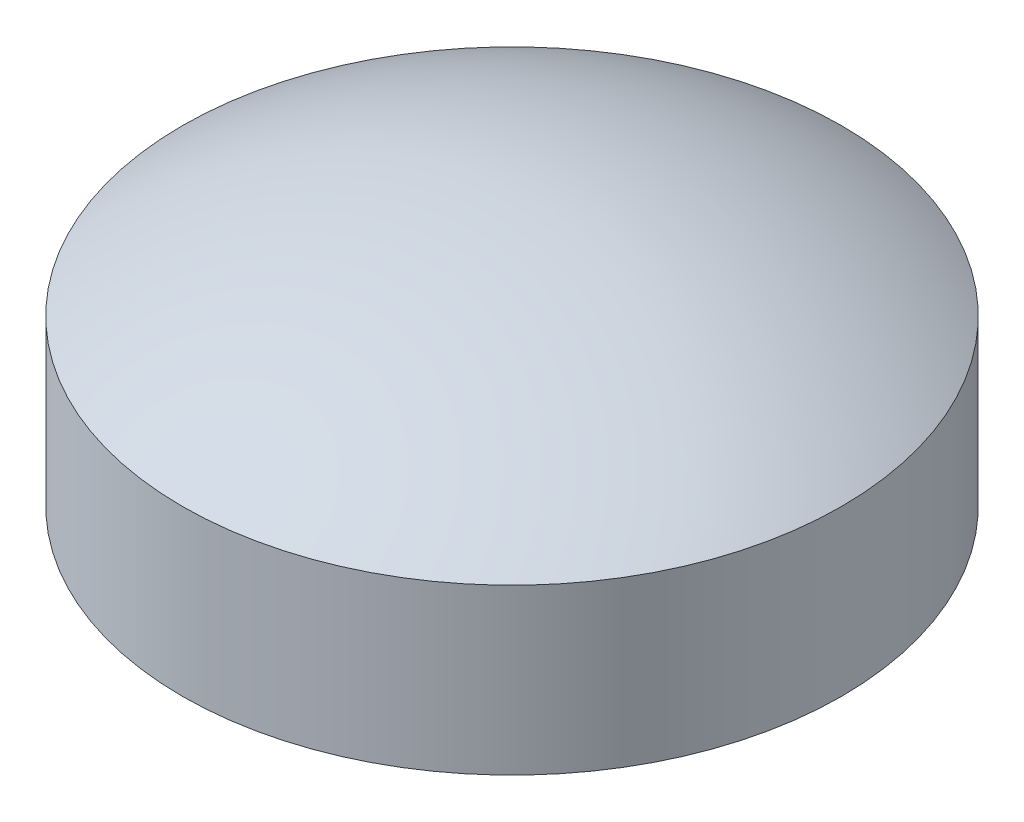
ISO-10303-21;
HEADER;
FILE_DESCRIPTION(('STEP AP214'),'2;1');
FILE_NAME('part.step','',(''),(''),'','','');
FILE_SCHEMA(('AUTOMOTIVE_DESIGN { 1 0 10303 214 1 1 1 1 }'));
ENDSEC;
DATA;
#1=APPLICATION_CONTEXT('core data for automotive mechanical design processes');
#2=APPLICATION_PROTOCOL_DEFINITION('international standard','automotive_design',2000,#1);
#3=PRODUCT_CONTEXT('',#1,'mechanical');
#4=PRODUCT('Part','Part','',(#3));
#5=PRODUCT_RELATED_PRODUCT_CATEGORY('part','',(#4));
#6=PRODUCT_DEFINITION_FORMATION('','',#4);
#7=PRODUCT_DEFINITION_CONTEXT('part definition',#1,'design');
#8=PRODUCT_DEFINITION('design','',#6,#7);
#9=PRODUCT_DEFINITION_SHAPE('','',#8);
#10=(LENGTH_UNIT() NAMED_UNIT(*) SI_UNIT(.MILLI.,.METRE.));
#11=(NAMED_UNIT(*) PLANE_ANGLE_UNIT() SI_UNIT($,.RADIAN.));
#12=(NAMED_UNIT(*) SI_UNIT($,.STERADIAN.) SOLID_ANGLE_UNIT());
#13=UNCERTAINTY_MEASURE_WITH_UNIT(LENGTH_MEASURE(1.E-05),#10,'distance_accuracy_value','');
#14=(GEOMETRIC_REPRESENTATION_CONTEXT(3) GLOBAL_UNCERTAINTY_ASSIGNED_CONTEXT((#13)) GLOBAL_UNIT_ASSIGNED_CONTEXT((#10,
#11,#12)) REPRESENTATION_CONTEXT('',''));
#15=CARTESIAN_POINT('',(0.,0.,0.));
#16=DIRECTION('',(0.,0.,1.));
#17=DIRECTION('',(1.,0.,0.));
#18=AXIS2_PLACEMENT_3D('',#15,#16,#17);
#19=CARTESIAN_POINT('',(0.,10.,0.));
#20=DIRECTION('',(0.,-1.,0.));
#21=DIRECTION('',(0.,0.,-1.));
#22=AXIS2_PLACEMENT_3D('',#19,#20,#21);
#23=CYLINDRICAL_SURFACE('',#22,20.0449835510423);
#24=CARTESIAN_POINT('',(0.,10.,0.));
#25=DIRECTION('',(0.,1.,0.));
#26=DIRECTION('',(0.,0.,1.));
#27=AXIS2_PLACEMENT_3D('',#24,#25,#26);
#28=CIRCLE('',#27,20.0449835510423);
#29=CARTESIAN_POINT('',(0.,10.,20.0449835510423));
#30=VERTEX_POINT('',#29);
#31=EDGE_CURVE('E10',#30,#30,#28,.T.);
#32=ORIENTED_EDGE('',*,*,#31,.F.);
#33=EDGE_LOOP('',(#32));
#34=FACE_BOUND('',#33,.T.);
#35=CARTESIAN_POINT('',(0.,0.,0.));
#36=DIRECTION('',(0.,1.,0.));
#37=DIRECTION('',(0.,0.,1.));
#38=AXIS2_PLACEMENT_3D('',#35,#36,#37);
#39=CIRCLE('',#38,20.0449835510423);
#40=CARTESIAN_POINT('',(0.,0.,20.0449835510423));
#41=VERTEX_POINT('',#40);
#42=EDGE_CURVE('E40',#41,#41,#39,.T.);
#43=ORIENTED_EDGE('',*,*,#42,.T.);
#44=EDGE_LOOP('',(#43));
#45=FACE_BOUND('',#44,.T.);
#46=ADVANCED_FACE('F33',(#34,#45),#23,.T.);
#47=CARTESIAN_POINT('',(0.,-20.4834471301297,0.));
#48=DIRECTION('',(0.,0.,1.));
#49=DIRECTION('',(1.,0.,0.));
#50=AXIS2_PLACEMENT_3D('',#47,#48,#49);
#51=SPHERICAL_SURFACE('',#50,36.4834471301297);
#52=CARTESIAN_POINT('',(0.,-20.4834471301297,0.));
#53=DIRECTION('',(0.,1.,0.));
#54=DIRECTION('',(0.,0.,1.));
#55=AXIS2_PLACEMENT_3D('',#52,#53,#54);
#56=SPHERICAL_SURFACE('',#55,36.4834471301297);
#57=ORIENTED_EDGE('',*,*,#31,.T.);
#58=EDGE_LOOP('',(#57));
#59=FACE_BOUND('',#58,.T.);
#60=ADVANCED_FACE('F35',(#59),#56,.T.);
#61=CARTESIAN_POINT('',(0.,0.,0.));
#62=DIRECTION('',(0.,1.,0.));
#63=DIRECTION('',(0.,0.,1.));
#64=AXIS2_PLACEMENT_3D('',#61,#62,#63);
#65=PLANE('',#64);
#66=ORIENTED_EDGE('',*,*,#42,.F.);
#67=EDGE_LOOP('',(#66));
#68=FACE_BOUND('',#67,.T.);
#69=ADVANCED_FACE('F47',(#68),#65,.F.);
#70=CLOSED_SHELL('',(#46,#60,#69));
#71=MANIFOLD_SOLID_BREP('B2',#70);
#72=ADVANCED_BREP_SHAPE_REPRESENTATION('',(#18,#71),#14);
#73=SHAPE_DEFINITION_REPRESENTATION(#9,#72);
ENDSEC;
END-ISO-10303-21;
